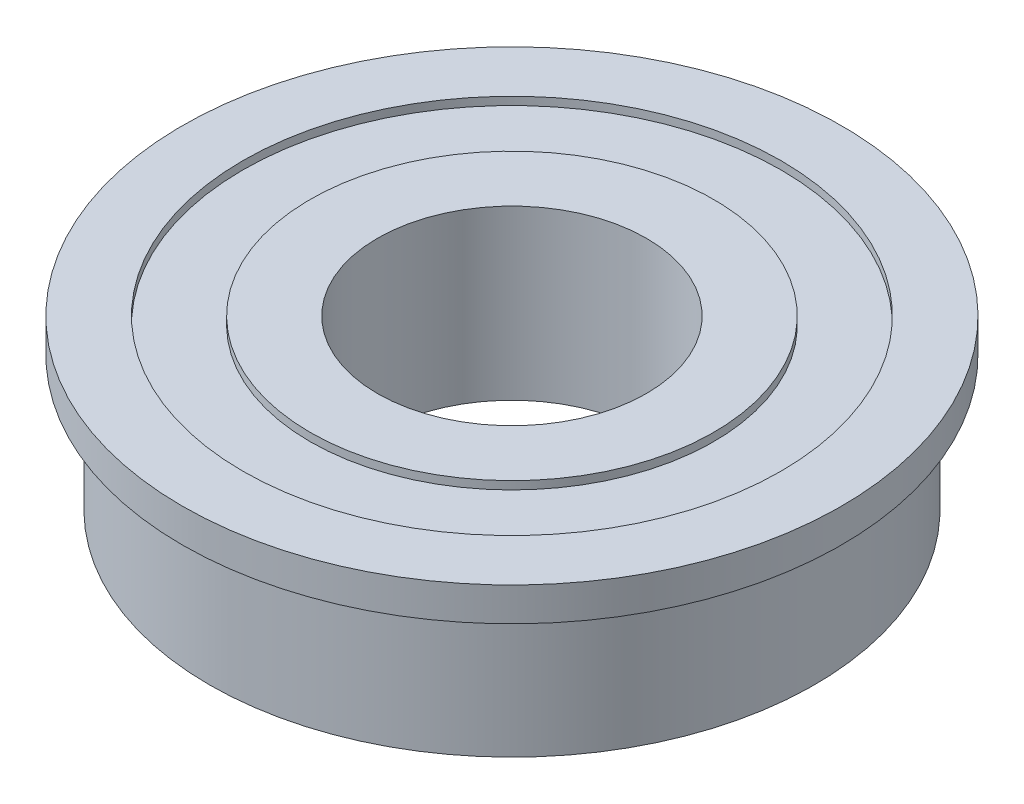
ISO-10303-21;
HEADER;
FILE_DESCRIPTION(('STEP AP214'),'2;1');
FILE_NAME('part.step','',(''),(''),'','','');
FILE_SCHEMA(('AUTOMOTIVE_DESIGN { 1 0 10303 214 1 1 1 1 }'));
ENDSEC;
DATA;
#1=APPLICATION_CONTEXT('core data for automotive mechanical design processes');
#2=APPLICATION_PROTOCOL_DEFINITION('international standard','automotive_design',2000,#1);
#3=PRODUCT_CONTEXT('',#1,'mechanical');
#4=PRODUCT('Part','Part','',(#3));
#5=PRODUCT_RELATED_PRODUCT_CATEGORY('part','',(#4));
#6=PRODUCT_DEFINITION_FORMATION('','',#4);
#7=PRODUCT_DEFINITION_CONTEXT('part definition',#1,'design');
#8=PRODUCT_DEFINITION('design','',#6,#7);
#9=PRODUCT_DEFINITION_SHAPE('','',#8);
#10=(LENGTH_UNIT() NAMED_UNIT(*) SI_UNIT(.MILLI.,.METRE.));
#11=(NAMED_UNIT(*) PLANE_ANGLE_UNIT() SI_UNIT($,.RADIAN.));
#12=(NAMED_UNIT(*) SI_UNIT($,.STERADIAN.) SOLID_ANGLE_UNIT());
#13=UNCERTAINTY_MEASURE_WITH_UNIT(LENGTH_MEASURE(1.E-05),#10,'distance_accuracy_value','');
#14=(GEOMETRIC_REPRESENTATION_CONTEXT(3) GLOBAL_UNCERTAINTY_ASSIGNED_CONTEXT((#13)) GLOBAL_UNIT_ASSIGNED_CONTEXT((#10,
#11,#12)) REPRESENTATION_CONTEXT('',''));
#15=CARTESIAN_POINT('',(0.,0.,0.));
#16=DIRECTION('',(0.,0.,1.));
#17=DIRECTION('',(1.,0.,0.));
#18=AXIS2_PLACEMENT_3D('',#15,#16,#17);
#19=CARTESIAN_POINT('',(0.,0.,0.));
#20=DIRECTION('',(0.,1.,0.));
#21=DIRECTION('',(0.,0.,1.));
#22=AXIS2_PLACEMENT_3D('',#19,#20,#21);
#23=CYLINDRICAL_SURFACE('',#22,12.7);
#24=CARTESIAN_POINT('',(0.,7.9375,0.));
#25=DIRECTION('',(0.,1.,0.));
#26=DIRECTION('',(0.,0.,1.));
#27=AXIS2_PLACEMENT_3D('',#24,#25,#26);
#28=CIRCLE('',#27,12.7);
#29=CARTESIAN_POINT('',(0.,7.9375,12.7));
#30=VERTEX_POINT('',#29);
#31=EDGE_CURVE('E46',#30,#30,#28,.F.);
#32=ORIENTED_EDGE('',*,*,#31,.F.);
#33=EDGE_LOOP('',(#32));
#34=FACE_BOUND('',#33,.T.);
#35=CARTESIAN_POINT('',(0.,7.5565,0.));
#36=DIRECTION('',(0.,1.,0.));
#37=DIRECTION('',(0.,0.,1.));
#38=AXIS2_PLACEMENT_3D('',#35,#36,#37);
#39=CIRCLE('',#38,12.7);
#40=CARTESIAN_POINT('',(0.,7.5565,12.7));
#41=VERTEX_POINT('',#40);
#42=EDGE_CURVE('E18',#41,#41,#39,.T.);
#43=ORIENTED_EDGE('',*,*,#42,.F.);
#44=EDGE_LOOP('',(#43));
#45=FACE_BOUND('',#44,.T.);
#46=ADVANCED_FACE('F15',(#34,#45),#23,.F.);
#47=CARTESIAN_POINT('',(9.525,7.5565,0.));
#48=DIRECTION('',(0.,1.,0.));
#49=DIRECTION('',(0.,0.,1.));
#50=AXIS2_PLACEMENT_3D('',#47,#48,#49);
#51=PLANE('',#50);
#52=CARTESIAN_POINT('',(0.,7.5565,0.));
#53=DIRECTION('',(0.,1.,0.));
#54=DIRECTION('',(0.,0.,1.));
#55=AXIS2_PLACEMENT_3D('',#52,#53,#54);
#56=CIRCLE('',#55,9.525);
#57=CARTESIAN_POINT('',(0.,7.5565,9.525));
#58=VERTEX_POINT('',#57);
#59=EDGE_CURVE('E44',#58,#58,#56,.T.);
#60=ORIENTED_EDGE('',*,*,#59,.F.);
#61=EDGE_LOOP('',(#60));
#62=FACE_BOUND('',#61,.T.);
#63=ORIENTED_EDGE('',*,*,#42,.T.);
#64=EDGE_LOOP('',(#63));
#65=FACE_BOUND('',#64,.T.);
#66=ADVANCED_FACE('F53',(#62,#65),#51,.T.);
#67=CARTESIAN_POINT('',(12.7,7.9375,0.));
#68=DIRECTION('',(0.,1.,0.));
#69=DIRECTION('',(0.,0.,1.));
#70=AXIS2_PLACEMENT_3D('',#67,#68,#69);
#71=PLANE('',#70);
#72=ORIENTED_EDGE('',*,*,#31,.T.);
#73=EDGE_LOOP('',(#72));
#74=FACE_BOUND('',#73,.T.);
#75=CARTESIAN_POINT('',(0.,7.9375,0.));
#76=DIRECTION('',(0.,1.,0.));
#77=DIRECTION('',(0.,0.,1.));
#78=AXIS2_PLACEMENT_3D('',#75,#76,#77);
#79=CIRCLE('',#78,15.5575);
#80=CARTESIAN_POINT('',(0.,7.9375,15.5575));
#81=VERTEX_POINT('',#80);
#82=EDGE_CURVE('E41',#81,#81,#79,.F.);
#83=ORIENTED_EDGE('',*,*,#82,.F.);
#84=EDGE_LOOP('',(#83));
#85=FACE_BOUND('',#84,.T.);
#86=ADVANCED_FACE('F61',(#74,#85),#71,.T.);
#87=CARTESIAN_POINT('',(0.,0.,0.));
#88=DIRECTION('',(0.,1.,0.));
#89=DIRECTION('',(0.,0.,1.));
#90=AXIS2_PLACEMENT_3D('',#87,#88,#89);
#91=CYLINDRICAL_SURFACE('',#90,9.525);
#92=ORIENTED_EDGE('',*,*,#59,.T.);
#93=EDGE_LOOP('',(#92));
#94=FACE_BOUND('',#93,.T.);
#95=CARTESIAN_POINT('',(0.,7.9375,0.));
#96=DIRECTION('',(0.,1.,0.));
#97=DIRECTION('',(0.,0.,1.));
#98=AXIS2_PLACEMENT_3D('',#95,#96,#97);
#99=CIRCLE('',#98,9.525);
#100=CARTESIAN_POINT('',(0.,7.9375,9.525));
#101=VERTEX_POINT('',#100);
#102=EDGE_CURVE('E38',#101,#101,#99,.T.);
#103=ORIENTED_EDGE('',*,*,#102,.F.);
#104=EDGE_LOOP('',(#103));
#105=FACE_BOUND('',#104,.T.);
#106=ADVANCED_FACE('F89',(#94,#105),#91,.T.);
#107=CARTESIAN_POINT('',(0.,0.,0.));
#108=DIRECTION('',(0.,1.,0.));
#109=DIRECTION('',(0.,0.,1.));
#110=AXIS2_PLACEMENT_3D('',#107,#108,#109);
#111=CYLINDRICAL_SURFACE('',#110,15.5575);
#112=CARTESIAN_POINT('',(0.,6.35,0.));
#113=DIRECTION('',(0.,1.,0.));
#114=DIRECTION('',(0.,0.,1.));
#115=AXIS2_PLACEMENT_3D('',#112,#113,#114);
#116=CIRCLE('',#115,15.5575);
#117=CARTESIAN_POINT('',(0.,6.35,15.5575));
#118=VERTEX_POINT('',#117);
#119=EDGE_CURVE('E35',#118,#118,#116,.F.);
#120=ORIENTED_EDGE('',*,*,#119,.F.);
#121=EDGE_LOOP('',(#120));
#122=FACE_BOUND('',#121,.T.);
#123=ORIENTED_EDGE('',*,*,#82,.T.);
#124=EDGE_LOOP('',(#123));
#125=FACE_BOUND('',#124,.T.);
#126=ADVANCED_FACE('F85',(#122,#125),#111,.T.);
#127=CARTESIAN_POINT('',(6.35,7.9375,0.));
#128=DIRECTION('',(0.,1.,0.));
#129=DIRECTION('',(0.,0.,1.));
#130=AXIS2_PLACEMENT_3D('',#127,#128,#129);
#131=PLANE('',#130);
#132=CARTESIAN_POINT('',(0.,7.9375,0.));
#133=DIRECTION('',(0.,1.,0.));
#134=DIRECTION('',(0.,0.,1.));
#135=AXIS2_PLACEMENT_3D('',#132,#133,#134);
#136=CIRCLE('',#135,6.35);
#137=CARTESIAN_POINT('',(0.,7.9375,6.35));
#138=VERTEX_POINT('',#137);
#139=EDGE_CURVE('E32',#138,#138,#136,.F.);
#140=ORIENTED_EDGE('',*,*,#139,.T.);
#141=EDGE_LOOP('',(#140));
#142=FACE_BOUND('',#141,.T.);
#143=ORIENTED_EDGE('',*,*,#102,.T.);
#144=EDGE_LOOP('',(#143));
#145=FACE_BOUND('',#144,.T.);
#146=ADVANCED_FACE('F81',(#142,#145),#131,.T.);
#147=CARTESIAN_POINT('',(15.5575,6.35,0.));
#148=DIRECTION('',(0.,-1.,0.));
#149=DIRECTION('',(0.,0.,-1.));
#150=AXIS2_PLACEMENT_3D('',#147,#148,#149);
#151=PLANE('',#150);
#152=ORIENTED_EDGE('',*,*,#119,.T.);
#153=EDGE_LOOP('',(#152));
#154=FACE_BOUND('',#153,.T.);
#155=CARTESIAN_POINT('',(0.,6.35,0.));
#156=DIRECTION('',(0.,1.,0.));
#157=DIRECTION('',(0.,0.,1.));
#158=AXIS2_PLACEMENT_3D('',#155,#156,#157);
#159=CIRCLE('',#158,14.2875);
#160=CARTESIAN_POINT('',(0.,6.35,14.2875));
#161=VERTEX_POINT('',#160);
#162=EDGE_CURVE('E27',#161,#161,#159,.F.);
#163=ORIENTED_EDGE('',*,*,#162,.F.);
#164=EDGE_LOOP('',(#163));
#165=FACE_BOUND('',#164,.T.);
#166=ADVANCED_FACE('F77',(#154,#165),#151,.T.);
#167=CARTESIAN_POINT('',(0.,0.,0.));
#168=DIRECTION('',(0.,1.,0.));
#169=DIRECTION('',(0.,0.,1.));
#170=AXIS2_PLACEMENT_3D('',#167,#168,#169);
#171=CYLINDRICAL_SURFACE('',#170,6.35);
#172=ORIENTED_EDGE('',*,*,#139,.F.);
#173=EDGE_LOOP('',(#172));
#174=FACE_BOUND('',#173,.T.);
#175=CARTESIAN_POINT('',(0.,0.,0.));
#176=DIRECTION('',(0.,1.,0.));
#177=DIRECTION('',(0.,0.,1.));
#178=AXIS2_PLACEMENT_3D('',#175,#176,#177);
#179=CIRCLE('',#178,6.35);
#180=CARTESIAN_POINT('',(0.,0.,6.35));
#181=VERTEX_POINT('',#180);
#182=EDGE_CURVE('E22',#181,#181,#179,.T.);
#183=ORIENTED_EDGE('',*,*,#182,.F.);
#184=EDGE_LOOP('',(#183));
#185=FACE_BOUND('',#184,.T.);
#186=ADVANCED_FACE('F70',(#174,#185),#171,.F.);
#187=CARTESIAN_POINT('',(0.,0.,0.));
#188=DIRECTION('',(0.,1.,0.));
#189=DIRECTION('',(0.,0.,1.));
#190=AXIS2_PLACEMENT_3D('',#187,#188,#189);
#191=CYLINDRICAL_SURFACE('',#190,14.2875);
#192=CARTESIAN_POINT('',(0.,0.,0.));
#193=DIRECTION('',(0.,1.,0.));
#194=DIRECTION('',(0.,0.,1.));
#195=AXIS2_PLACEMENT_3D('',#192,#193,#194);
#196=CIRCLE('',#195,14.2875);
#197=CARTESIAN_POINT('',(0.,0.,14.2875));
#198=VERTEX_POINT('',#197);
#199=EDGE_CURVE('E10',#198,#198,#196,.F.);
#200=ORIENTED_EDGE('',*,*,#199,.F.);
#201=EDGE_LOOP('',(#200));
#202=FACE_BOUND('',#201,.T.);
#203=ORIENTED_EDGE('',*,*,#162,.T.);
#204=EDGE_LOOP('',(#203));
#205=FACE_BOUND('',#204,.T.);
#206=ADVANCED_FACE('F65',(#202,#205),#191,.T.);
#207=CARTESIAN_POINT('',(14.2875,0.,0.));
#208=DIRECTION('',(0.,-1.,0.));
#209=DIRECTION('',(0.,0.,-1.));
#210=AXIS2_PLACEMENT_3D('',#207,#208,#209);
#211=PLANE('',#210);
#212=ORIENTED_EDGE('',*,*,#199,.T.);
#213=EDGE_LOOP('',(#212));
#214=FACE_BOUND('',#213,.T.);
#215=ORIENTED_EDGE('',*,*,#182,.T.);
#216=EDGE_LOOP('',(#215));
#217=FACE_BOUND('',#216,.T.);
#218=ADVANCED_FACE('F63',(#214,#217),#211,.T.);
#219=CLOSED_SHELL('',(#46,#66,#86,#106,#126,#146,#166,#186,#206,#218));
#220=MANIFOLD_SOLID_BREP('B1',#219);
#221=ADVANCED_BREP_SHAPE_REPRESENTATION('',(#18,#220),#14);
#222=SHAPE_DEFINITION_REPRESENTATION(#9,#221);
ENDSEC;
END-ISO-10303-21;
